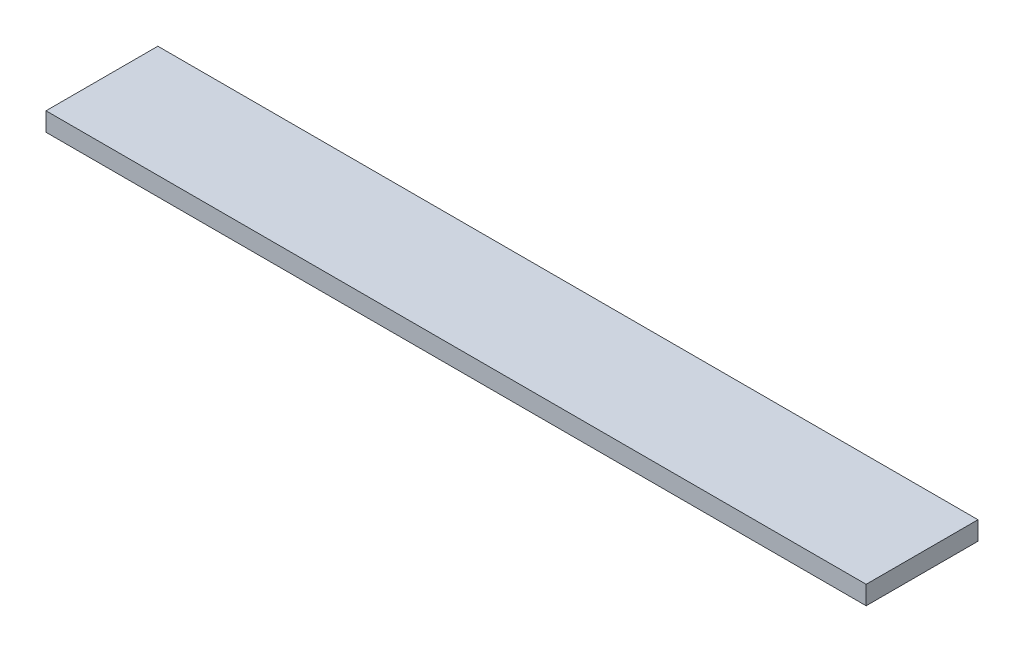
ISO-10303-21;
HEADER;
FILE_DESCRIPTION(('STEP AP214'),'2;1');
FILE_NAME('part.step','',(''),(''),'','','');
FILE_SCHEMA(('AUTOMOTIVE_DESIGN { 1 0 10303 214 1 1 1 1 }'));
ENDSEC;
DATA;
#1=APPLICATION_CONTEXT('core data for automotive mechanical design processes');
#2=APPLICATION_PROTOCOL_DEFINITION('international standard','automotive_design',2000,#1);
#3=PRODUCT_CONTEXT('',#1,'mechanical');
#4=PRODUCT('Part','Part','',(#3));
#5=PRODUCT_RELATED_PRODUCT_CATEGORY('part','',(#4));
#6=PRODUCT_DEFINITION_FORMATION('','',#4);
#7=PRODUCT_DEFINITION_CONTEXT('part definition',#1,'design');
#8=PRODUCT_DEFINITION('design','',#6,#7);
#9=PRODUCT_DEFINITION_SHAPE('','',#8);
#10=(LENGTH_UNIT() NAMED_UNIT(*) SI_UNIT(.MILLI.,.METRE.));
#11=(NAMED_UNIT(*) PLANE_ANGLE_UNIT() SI_UNIT($,.RADIAN.));
#12=(NAMED_UNIT(*) SI_UNIT($,.STERADIAN.) SOLID_ANGLE_UNIT());
#13=UNCERTAINTY_MEASURE_WITH_UNIT(LENGTH_MEASURE(1.E-05),#10,'distance_accuracy_value','');
#14=(GEOMETRIC_REPRESENTATION_CONTEXT(3) GLOBAL_UNCERTAINTY_ASSIGNED_CONTEXT((#13)) GLOBAL_UNIT_ASSIGNED_CONTEXT((#10,
#11,#12)) REPRESENTATION_CONTEXT('',''));
#15=CARTESIAN_POINT('',(0.,0.,0.));
#16=DIRECTION('',(0.,0.,1.));
#17=DIRECTION('',(1.,0.,0.));
#18=AXIS2_PLACEMENT_3D('',#15,#16,#17);
#19=CARTESIAN_POINT('',(-87.5655259579846,12.7,-41.0362320228269));
#20=DIRECTION('',(1.,0.,0.));
#21=DIRECTION('',(0.,0.,-1.));
#22=AXIS2_PLACEMENT_3D('',#19,#20,#21);
#23=PLANE('',#22);
#24=DIRECTION('',(0.,0.,1.));
#25=VECTOR('',#24,1.);
#26=CARTESIAN_POINT('',(-87.5655259579846,0.,-41.0362320228269));
#27=LINE('',#26,#25);
#28=CARTESIAN_POINT('',(-87.5655259579846,0.,-41.0362320228269));
#29=VERTEX_POINT('',#28);
#30=CARTESIAN_POINT('',(-87.5655259579846,0.,35.1637679771731));
#31=VERTEX_POINT('',#30);
#32=EDGE_CURVE('E98',#29,#31,#27,.T.);
#33=ORIENTED_EDGE('',*,*,#32,.T.);
#34=DIRECTION('',(0.,-1.,0.));
#35=VECTOR('',#34,1.);
#36=CARTESIAN_POINT('',(-87.5655259579846,12.7,35.1637679771731));
#37=LINE('',#36,#35);
#38=CARTESIAN_POINT('',(-87.5655259579846,12.7,35.1637679771731));
#39=VERTEX_POINT('',#38);
#40=EDGE_CURVE('E11',#39,#31,#37,.T.);
#41=ORIENTED_EDGE('',*,*,#40,.F.);
#42=DIRECTION('',(0.,0.,1.));
#43=VECTOR('',#42,1.);
#44=CARTESIAN_POINT('',(-87.5655259579846,12.7,-41.0362320228269));
#45=LINE('',#44,#43);
#46=CARTESIAN_POINT('',(-87.5655259579846,12.7,-41.0362320228269));
#47=VERTEX_POINT('',#46);
#48=EDGE_CURVE('E86',#47,#39,#45,.T.);
#49=ORIENTED_EDGE('',*,*,#48,.F.);
#50=DIRECTION('',(0.,-1.,0.));
#51=VECTOR('',#50,1.);
#52=CARTESIAN_POINT('',(-87.5655259579846,12.7,-41.0362320228269));
#53=LINE('',#52,#51);
#54=EDGE_CURVE('E94',#47,#29,#53,.T.);
#55=ORIENTED_EDGE('',*,*,#54,.T.);
#56=EDGE_LOOP('',(#33,#41,#49,#55));
#57=FACE_BOUND('',#56,.T.);
#58=ADVANCED_FACE('F35',(#57),#23,.F.);
#59=CARTESIAN_POINT('',(-87.5655259579846,12.7,35.1637679771731));
#60=DIRECTION('',(0.,0.,-1.));
#61=DIRECTION('',(-1.,0.,0.));
#62=AXIS2_PLACEMENT_3D('',#59,#60,#61);
#63=PLANE('',#62);
#64=DIRECTION('',(1.,0.,0.));
#65=VECTOR('',#64,1.);
#66=CARTESIAN_POINT('',(-87.5655259579846,0.,35.1637679771731));
#67=LINE('',#66,#65);
#68=CARTESIAN_POINT('',(471.234474042015,0.,35.1637679771731));
#69=VERTEX_POINT('',#68);
#70=EDGE_CURVE('E90',#31,#69,#67,.T.);
#71=ORIENTED_EDGE('',*,*,#70,.T.);
#72=DIRECTION('',(0.,-1.,0.));
#73=VECTOR('',#72,1.);
#74=CARTESIAN_POINT('',(471.234474042015,12.7,35.1637679771731));
#75=LINE('',#74,#73);
#76=CARTESIAN_POINT('',(471.234474042015,12.7,35.1637679771731));
#77=VERTEX_POINT('',#76);
#78=EDGE_CURVE('E43',#77,#69,#75,.T.);
#79=ORIENTED_EDGE('',*,*,#78,.F.);
#80=DIRECTION('',(1.,0.,0.));
#81=VECTOR('',#80,1.);
#82=CARTESIAN_POINT('',(-87.5655259579846,12.7,35.1637679771731));
#83=LINE('',#82,#81);
#84=EDGE_CURVE('E81',#39,#77,#83,.T.);
#85=ORIENTED_EDGE('',*,*,#84,.F.);
#86=ORIENTED_EDGE('',*,*,#40,.T.);
#87=EDGE_LOOP('',(#71,#79,#85,#86));
#88=FACE_BOUND('',#87,.T.);
#89=ADVANCED_FACE('F89',(#88),#63,.F.);
#90=CARTESIAN_POINT('',(471.234474042015,12.7,-41.0362320228269));
#91=DIRECTION('',(-1.,0.,0.));
#92=DIRECTION('',(0.,0.,1.));
#93=AXIS2_PLACEMENT_3D('',#90,#91,#92);
#94=PLANE('',#93);
#95=DIRECTION('',(0.,0.,-1.));
#96=VECTOR('',#95,1.);
#97=CARTESIAN_POINT('',(471.234474042015,0.,-41.0362320228269));
#98=LINE('',#97,#96);
#99=CARTESIAN_POINT('',(471.234474042015,0.,-41.0362320228269));
#100=VERTEX_POINT('',#99);
#101=EDGE_CURVE('E68',#69,#100,#98,.T.);
#102=ORIENTED_EDGE('',*,*,#101,.T.);
#103=DIRECTION('',(0.,-1.,0.));
#104=VECTOR('',#103,1.);
#105=CARTESIAN_POINT('',(471.234474042015,12.7,-41.0362320228269));
#106=LINE('',#105,#104);
#107=CARTESIAN_POINT('',(471.234474042015,12.7,-41.0362320228269));
#108=VERTEX_POINT('',#107);
#109=EDGE_CURVE('E91',#108,#100,#106,.T.);
#110=ORIENTED_EDGE('',*,*,#109,.F.);
#111=DIRECTION('',(0.,0.,-1.));
#112=VECTOR('',#111,1.);
#113=CARTESIAN_POINT('',(471.234474042015,12.7,-41.0362320228269));
#114=LINE('',#113,#112);
#115=EDGE_CURVE('E84',#77,#108,#114,.T.);
#116=ORIENTED_EDGE('',*,*,#115,.F.);
#117=ORIENTED_EDGE('',*,*,#78,.T.);
#118=EDGE_LOOP('',(#102,#110,#116,#117));
#119=FACE_BOUND('',#118,.T.);
#120=ADVANCED_FACE('F92',(#119),#94,.F.);
#121=CARTESIAN_POINT('',(-87.5655259579846,12.7,-41.0362320228269));
#122=DIRECTION('',(0.,0.,1.));
#123=DIRECTION('',(1.,0.,0.));
#124=AXIS2_PLACEMENT_3D('',#121,#122,#123);
#125=PLANE('',#124);
#126=DIRECTION('',(-1.,0.,0.));
#127=VECTOR('',#126,1.);
#128=CARTESIAN_POINT('',(-87.5655259579846,0.,-41.0362320228269));
#129=LINE('',#128,#127);
#130=EDGE_CURVE('E74',#100,#29,#129,.T.);
#131=ORIENTED_EDGE('',*,*,#130,.T.);
#132=ORIENTED_EDGE('',*,*,#54,.F.);
#133=DIRECTION('',(-1.,0.,0.));
#134=VECTOR('',#133,1.);
#135=CARTESIAN_POINT('',(-87.5655259579846,12.7,-41.0362320228269));
#136=LINE('',#135,#134);
#137=EDGE_CURVE('E51',#108,#47,#136,.T.);
#138=ORIENTED_EDGE('',*,*,#137,.F.);
#139=ORIENTED_EDGE('',*,*,#109,.T.);
#140=EDGE_LOOP('',(#131,#132,#138,#139));
#141=FACE_BOUND('',#140,.T.);
#142=ADVANCED_FACE('F105',(#141),#125,.F.);
#143=CARTESIAN_POINT('',(0.,12.7,0.));
#144=DIRECTION('',(0.,1.,0.));
#145=DIRECTION('',(0.,0.,1.));
#146=AXIS2_PLACEMENT_3D('',#143,#144,#145);
#147=PLANE('',#146);
#148=ORIENTED_EDGE('',*,*,#48,.T.);
#149=ORIENTED_EDGE('',*,*,#84,.T.);
#150=ORIENTED_EDGE('',*,*,#115,.T.);
#151=ORIENTED_EDGE('',*,*,#137,.T.);
#152=EDGE_LOOP('',(#148,#149,#150,#151));
#153=FACE_BOUND('',#152,.T.);
#154=ADVANCED_FACE('F82',(#153),#147,.T.);
#155=CARTESIAN_POINT('',(0.,0.,0.));
#156=DIRECTION('',(0.,1.,0.));
#157=DIRECTION('',(0.,0.,1.));
#158=AXIS2_PLACEMENT_3D('',#155,#156,#157);
#159=PLANE('',#158);
#160=ORIENTED_EDGE('',*,*,#32,.F.);
#161=ORIENTED_EDGE('',*,*,#130,.F.);
#162=ORIENTED_EDGE('',*,*,#101,.F.);
#163=ORIENTED_EDGE('',*,*,#70,.F.);
#164=EDGE_LOOP('',(#160,#161,#162,#163));
#165=FACE_BOUND('',#164,.T.);
#166=ADVANCED_FACE('F108',(#165),#159,.F.);
#167=CLOSED_SHELL('',(#58,#89,#120,#142,#154,#166));
#168=MANIFOLD_SOLID_BREP('B2',#167);
#169=ADVANCED_BREP_SHAPE_REPRESENTATION('',(#18,#168),#14);
#170=SHAPE_DEFINITION_REPRESENTATION(#9,#169);
ENDSEC;
END-ISO-10303-21;
